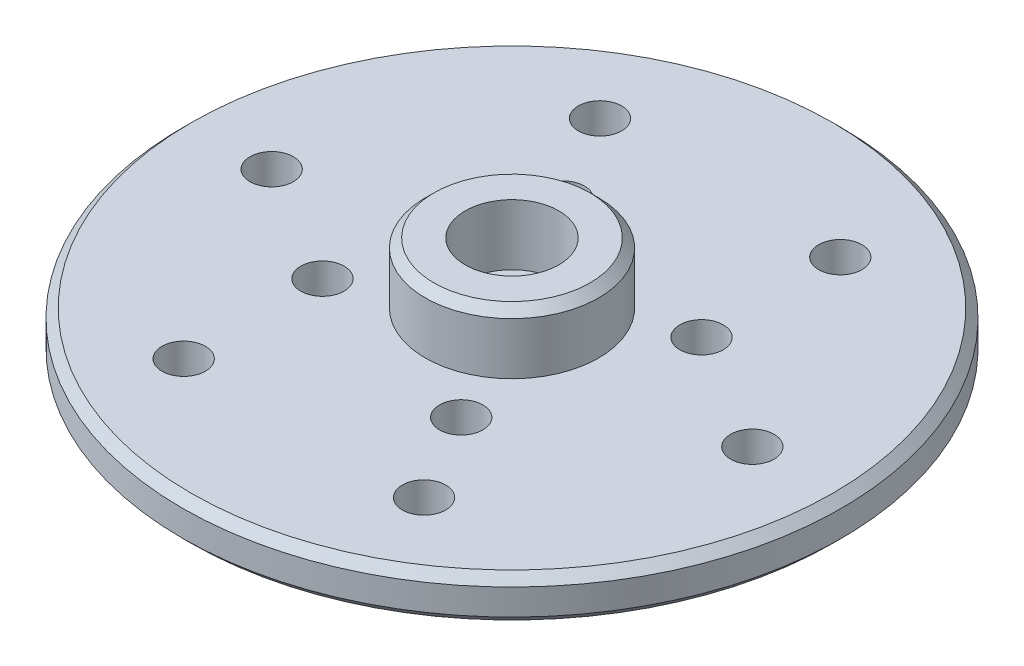
ISO-10303-21;
HEADER;
FILE_DESCRIPTION(('STEP AP214'),'2;1');
FILE_NAME('part.step','',(''),(''),'','','');
FILE_SCHEMA(('AUTOMOTIVE_DESIGN { 1 0 10303 214 1 1 1 1 }'));
ENDSEC;
DATA;
#1=APPLICATION_CONTEXT('core data for automotive mechanical design processes');
#2=APPLICATION_PROTOCOL_DEFINITION('international standard','automotive_design',2000,#1);
#3=PRODUCT_CONTEXT('',#1,'mechanical');
#4=PRODUCT('Part','Part','',(#3));
#5=PRODUCT_RELATED_PRODUCT_CATEGORY('part','',(#4));
#6=PRODUCT_DEFINITION_FORMATION('','',#4);
#7=PRODUCT_DEFINITION_CONTEXT('part definition',#1,'design');
#8=PRODUCT_DEFINITION('design','',#6,#7);
#9=PRODUCT_DEFINITION_SHAPE('','',#8);
#10=(LENGTH_UNIT() NAMED_UNIT(*) SI_UNIT(.MILLI.,.METRE.));
#11=(NAMED_UNIT(*) PLANE_ANGLE_UNIT() SI_UNIT($,.RADIAN.));
#12=(NAMED_UNIT(*) SI_UNIT($,.STERADIAN.) SOLID_ANGLE_UNIT());
#13=UNCERTAINTY_MEASURE_WITH_UNIT(LENGTH_MEASURE(1.E-05),#10,'distance_accuracy_value','');
#14=(GEOMETRIC_REPRESENTATION_CONTEXT(3) GLOBAL_UNCERTAINTY_ASSIGNED_CONTEXT((#13)) GLOBAL_UNIT_ASSIGNED_CONTEXT((#10,
#11,#12)) REPRESENTATION_CONTEXT('',''));
#15=CARTESIAN_POINT('',(0.,0.,0.));
#16=DIRECTION('',(0.,0.,1.));
#17=DIRECTION('',(1.,0.,0.));
#18=AXIS2_PLACEMENT_3D('',#15,#16,#17);
#19=CARTESIAN_POINT('',(0.,5.50000000004047,0.));
#20=DIRECTION('',(0.,-1.,0.));
#21=DIRECTION('',(0.,0.,-1.));
#22=AXIS2_PLACEMENT_3D('',#19,#20,#21);
#23=CONICAL_SURFACE('',#22,4.99999999999545,0.785398163397448);
#24=CARTESIAN_POINT('',(0.,5.49999999999999,0.));
#25=DIRECTION('',(0.,-1.,0.));
#26=DIRECTION('',(0.,0.,-1.));
#27=AXIS2_PLACEMENT_3D('',#24,#25,#26);
#28=CIRCLE('',#27,5.);
#29=CARTESIAN_POINT('',(0.,5.49999999999999,-5.));
#30=VERTEX_POINT('',#29);
#31=EDGE_CURVE('E30',#30,#30,#28,.T.);
#32=ORIENTED_EDGE('',*,*,#31,.F.);
#33=EDGE_LOOP('',(#32));
#34=FACE_BOUND('',#33,.T.);
#35=CARTESIAN_POINT('',(0.,6.00000000002865,0.));
#36=DIRECTION('',(0.,-1.,0.));
#37=DIRECTION('',(0.,0.,-1.));
#38=AXIS2_PLACEMENT_3D('',#35,#36,#37);
#39=CIRCLE('',#38,4.50000000000728);
#40=CARTESIAN_POINT('',(0.,6.00000000002865,-4.50000000000728));
#41=VERTEX_POINT('',#40);
#42=EDGE_CURVE('E18',#41,#41,#39,.F.);
#43=ORIENTED_EDGE('',*,*,#42,.F.);
#44=EDGE_LOOP('',(#43));
#45=FACE_BOUND('',#44,.T.);
#46=ADVANCED_FACE('F15',(#34,#45),#23,.T.);
#47=CARTESIAN_POINT('',(0.,6.,0.));
#48=DIRECTION('',(0.,1.,0.));
#49=DIRECTION('',(0.,0.,1.));
#50=AXIS2_PLACEMENT_3D('',#47,#48,#49);
#51=PLANE('',#50);
#52=CARTESIAN_POINT('',(0.,6.,0.));
#53=DIRECTION('',(0.,-1.,0.));
#54=DIRECTION('',(0.,0.,-1.));
#55=AXIS2_PLACEMENT_3D('',#52,#53,#54);
#56=CIRCLE('',#55,2.7);
#57=CARTESIAN_POINT('',(0.,6.,-2.7));
#58=VERTEX_POINT('',#57);
#59=EDGE_CURVE('E105',#58,#58,#56,.T.);
#60=ORIENTED_EDGE('',*,*,#59,.T.);
#61=EDGE_LOOP('',(#60));
#62=FACE_BOUND('',#61,.T.);
#63=ORIENTED_EDGE('',*,*,#42,.T.);
#64=EDGE_LOOP('',(#63));
#65=FACE_BOUND('',#64,.T.);
#66=ADVANCED_FACE('F116',(#62,#65),#51,.T.);
#67=CARTESIAN_POINT('',(0.,2.00000000000002,0.));
#68=DIRECTION('',(0.,-1.,0.));
#69=DIRECTION('',(0.,0.,-1.));
#70=AXIS2_PLACEMENT_3D('',#67,#68,#69);
#71=CONICAL_SURFACE('',#70,19.0000000009398,0.785398163397445);
#72=CARTESIAN_POINT('',(0.,2.00000000000002,0.));
#73=DIRECTION('',(0.,-1.,0.));
#74=DIRECTION('',(0.,0.,-1.));
#75=AXIS2_PLACEMENT_3D('',#72,#73,#74);
#76=CIRCLE('',#75,19.0000000009398);
#77=CARTESIAN_POINT('',(0.,2.00000000000002,-19.0000000009398));
#78=VERTEX_POINT('',#77);
#79=EDGE_CURVE('E104',#78,#78,#76,.T.);
#80=ORIENTED_EDGE('',*,*,#79,.F.);
#81=EDGE_LOOP('',(#80));
#82=FACE_BOUND('',#81,.T.);
#83=CARTESIAN_POINT('',(0.,2.5,0.));
#84=DIRECTION('',(0.,-1.,0.));
#85=DIRECTION('',(0.,0.,-1.));
#86=AXIS2_PLACEMENT_3D('',#83,#84,#85);
#87=CIRCLE('',#86,18.5000000009398);
#88=CARTESIAN_POINT('',(0.,2.5,-18.5000000009398));
#89=VERTEX_POINT('',#88);
#90=EDGE_CURVE('E102',#89,#89,#87,.F.);
#91=ORIENTED_EDGE('',*,*,#90,.F.);
#92=EDGE_LOOP('',(#91));
#93=FACE_BOUND('',#92,.T.);
#94=ADVANCED_FACE('F123',(#82,#93),#71,.T.);
#95=CARTESIAN_POINT('',(0.,6.,0.));
#96=DIRECTION('',(0.,-1.,0.));
#97=DIRECTION('',(0.,0.,-1.));
#98=AXIS2_PLACEMENT_3D('',#95,#96,#97);
#99=CYLINDRICAL_SURFACE('',#98,5.);
#100=CARTESIAN_POINT('',(0.,2.5,0.));
#101=DIRECTION('',(0.,-1.,0.));
#102=DIRECTION('',(0.,0.,-1.));
#103=AXIS2_PLACEMENT_3D('',#100,#101,#102);
#104=CIRCLE('',#103,5.);
#105=CARTESIAN_POINT('',(0.,2.5,-5.));
#106=VERTEX_POINT('',#105);
#107=EDGE_CURVE('E99',#106,#106,#104,.T.);
#108=ORIENTED_EDGE('',*,*,#107,.F.);
#109=EDGE_LOOP('',(#108));
#110=FACE_BOUND('',#109,.T.);
#111=ORIENTED_EDGE('',*,*,#31,.T.);
#112=EDGE_LOOP('',(#111));
#113=FACE_BOUND('',#112,.T.);
#114=ADVANCED_FACE('F194',(#110,#113),#99,.T.);
#115=CARTESIAN_POINT('',(0.,6.,0.));
#116=DIRECTION('',(0.,-1.,0.));
#117=DIRECTION('',(0.,0.,-1.));
#118=AXIS2_PLACEMENT_3D('',#115,#116,#117);
#119=CYLINDRICAL_SURFACE('',#118,2.7);
#120=CARTESIAN_POINT('',(0.,2.5,0.));
#121=DIRECTION('',(0.,-1.,0.));
#122=DIRECTION('',(0.,0.,-1.));
#123=AXIS2_PLACEMENT_3D('',#120,#121,#122);
#124=CIRCLE('',#123,2.7);
#125=CARTESIAN_POINT('',(0.,2.5,-2.7));
#126=VERTEX_POINT('',#125);
#127=EDGE_CURVE('E96',#126,#126,#124,.F.);
#128=ORIENTED_EDGE('',*,*,#127,.F.);
#129=EDGE_LOOP('',(#128));
#130=FACE_BOUND('',#129,.T.);
#131=ORIENTED_EDGE('',*,*,#59,.F.);
#132=EDGE_LOOP('',(#131));
#133=FACE_BOUND('',#132,.T.);
#134=ADVANCED_FACE('F190',(#130,#133),#119,.F.);
#135=CARTESIAN_POINT('',(0.,2.5,0.));
#136=DIRECTION('',(0.,-1.,0.));
#137=DIRECTION('',(0.,0.,-1.));
#138=AXIS2_PLACEMENT_3D('',#135,#136,#137);
#139=CYLINDRICAL_SURFACE('',#138,19.0000000009398);
#140=ORIENTED_EDGE('',*,*,#79,.T.);
#141=EDGE_LOOP('',(#140));
#142=FACE_BOUND('',#141,.T.);
#143=CARTESIAN_POINT('',(0.,0.499999999999997,0.));
#144=DIRECTION('',(0.,1.,0.));
#145=DIRECTION('',(0.,0.,1.));
#146=AXIS2_PLACEMENT_3D('',#143,#144,#145);
#147=CIRCLE('',#146,19.0000000009398);
#148=CARTESIAN_POINT('',(0.,0.499999999999997,19.0000000009398));
#149=VERTEX_POINT('',#148);
#150=EDGE_CURVE('E95',#149,#149,#147,.F.);
#151=ORIENTED_EDGE('',*,*,#150,.F.);
#152=EDGE_LOOP('',(#151));
#153=FACE_BOUND('',#152,.T.);
#154=ADVANCED_FACE('F186',(#142,#153),#139,.T.);
#155=CARTESIAN_POINT('',(0.,2.5,0.));
#156=DIRECTION('',(0.,1.,0.));
#157=DIRECTION('',(0.,0.,1.));
#158=AXIS2_PLACEMENT_3D('',#155,#156,#157);
#159=PLANE('',#158);
#160=CARTESIAN_POINT('',(4.0000000009961,2.5,6.92820323018273));
#161=DIRECTION('',(0.,-1.,0.));
#162=DIRECTION('',(0.,0.,-1.));
#163=AXIS2_PLACEMENT_3D('',#160,#161,#162);
#164=CIRCLE('',#163,1.24999999999886);
#165=CARTESIAN_POINT('',(4.0000000009961,2.5,5.67820323018386));
#166=VERTEX_POINT('',#165);
#167=EDGE_CURVE('E68',#166,#166,#164,.T.);
#168=ORIENTED_EDGE('',*,*,#167,.T.);
#169=EDGE_LOOP('',(#168));
#170=FACE_BOUND('',#169,.T.);
#171=CARTESIAN_POINT('',(-6.92820323019561,2.5,4.00000000097478));
#172=DIRECTION('',(0.,-1.,0.));
#173=DIRECTION('',(0.,0.,-1.));
#174=AXIS2_PLACEMENT_3D('',#171,#172,#173);
#175=CIRCLE('',#174,1.24999999999886);
#176=CARTESIAN_POINT('',(-6.92820323019561,2.5,2.75000000097592));
#177=VERTEX_POINT('',#176);
#178=EDGE_CURVE('E74',#177,#177,#175,.T.);
#179=ORIENTED_EDGE('',*,*,#178,.T.);
#180=EDGE_LOOP('',(#179));
#181=FACE_BOUND('',#180,.T.);
#182=CARTESIAN_POINT('',(-4.0000000010032,2.5,-6.92820323017962));
#183=DIRECTION('',(0.,-1.,0.));
#184=DIRECTION('',(0.,0.,-1.));
#185=AXIS2_PLACEMENT_3D('',#182,#183,#184);
#186=CIRCLE('',#185,1.24999999999886);
#187=CARTESIAN_POINT('',(-4.0000000010032,2.5,-8.17820323017848));
#188=VERTEX_POINT('',#187);
#189=EDGE_CURVE('E80',#188,#188,#186,.T.);
#190=ORIENTED_EDGE('',*,*,#189,.T.);
#191=EDGE_LOOP('',(#190));
#192=FACE_BOUND('',#191,.T.);
#193=CARTESIAN_POINT('',(13.8564064603592,2.5,0.));
#194=DIRECTION('',(0.,-1.,0.));
#195=DIRECTION('',(0.,0.,-1.));
#196=AXIS2_PLACEMENT_3D('',#193,#194,#195);
#197=CIRCLE('',#196,1.24999999999886);
#198=CARTESIAN_POINT('',(13.8564064603592,2.5,-1.24999999999886));
#199=VERTEX_POINT('',#198);
#200=EDGE_CURVE('E86',#199,#199,#197,.T.);
#201=ORIENTED_EDGE('',*,*,#200,.T.);
#202=EDGE_LOOP('',(#201));
#203=FACE_BOUND('',#202,.T.);
#204=CARTESIAN_POINT('',(-6.9282032318263,2.5,-11.9999999995111));
#205=DIRECTION('',(0.,-1.,0.));
#206=DIRECTION('',(0.,0.,-1.));
#207=AXIS2_PLACEMENT_3D('',#204,#205,#206);
#208=CIRCLE('',#207,1.24999999999886);
#209=CARTESIAN_POINT('',(-6.9282032318263,2.5,-13.2499999995099));
#210=VERTEX_POINT('',#209);
#211=EDGE_CURVE('E92',#210,#210,#208,.T.);
#212=ORIENTED_EDGE('',*,*,#211,.T.);
#213=EDGE_LOOP('',(#212));
#214=FACE_BOUND('',#213,.T.);
#215=CARTESIAN_POINT('',(6.92820322963072,2.5,-11.9999999995111));
#216=DIRECTION('',(0.,-1.,0.));
#217=DIRECTION('',(0.,0.,-1.));
#218=AXIS2_PLACEMENT_3D('',#215,#216,#217);
#219=CIRCLE('',#218,1.24999999999886);
#220=CARTESIAN_POINT('',(6.92820322963072,2.5,-13.2499999995099));
#221=VERTEX_POINT('',#220);
#222=EDGE_CURVE('E89',#221,#221,#219,.T.);
#223=ORIENTED_EDGE('',*,*,#222,.T.);
#224=EDGE_LOOP('',(#223));
#225=FACE_BOUND('',#224,.T.);
#226=CARTESIAN_POINT('',(6.92820323019561,2.5,-4.00000000097478));
#227=DIRECTION('',(0.,-1.,0.));
#228=DIRECTION('',(0.,0.,-1.));
#229=AXIS2_PLACEMENT_3D('',#226,#227,#228);
#230=CIRCLE('',#229,1.24999999999886);
#231=CARTESIAN_POINT('',(6.92820323019561,2.5,-5.25000000097364));
#232=VERTEX_POINT('',#231);
#233=EDGE_CURVE('E83',#232,#232,#230,.T.);
#234=ORIENTED_EDGE('',*,*,#233,.T.);
#235=EDGE_LOOP('',(#234));
#236=FACE_BOUND('',#235,.T.);
#237=CARTESIAN_POINT('',(-13.8564064609028,2.5,0.));
#238=DIRECTION('',(0.,-1.,0.));
#239=DIRECTION('',(0.,0.,-1.));
#240=AXIS2_PLACEMENT_3D('',#237,#238,#239);
#241=CIRCLE('',#240,1.24999999999886);
#242=CARTESIAN_POINT('',(-13.8564064609028,2.5,-1.24999999999886));
#243=VERTEX_POINT('',#242);
#244=EDGE_CURVE('E77',#243,#243,#241,.T.);
#245=ORIENTED_EDGE('',*,*,#244,.T.);
#246=EDGE_LOOP('',(#245));
#247=FACE_BOUND('',#246,.T.);
#248=CARTESIAN_POINT('',(-6.92820323017784,2.5,11.9999999979203));
#249=DIRECTION('',(0.,-1.,0.));
#250=DIRECTION('',(0.,0.,-1.));
#251=AXIS2_PLACEMENT_3D('',#248,#249,#250);
#252=CIRCLE('',#251,1.24999999999886);
#253=CARTESIAN_POINT('',(-6.92820323017784,2.5,10.7499999979215));
#254=VERTEX_POINT('',#253);
#255=EDGE_CURVE('E71',#254,#254,#252,.T.);
#256=ORIENTED_EDGE('',*,*,#255,.T.);
#257=EDGE_LOOP('',(#256));
#258=FACE_BOUND('',#257,.T.);
#259=CARTESIAN_POINT('',(6.9282032318192,2.5,11.9999999995146));
#260=DIRECTION('',(0.,-1.,0.));
#261=DIRECTION('',(0.,0.,-1.));
#262=AXIS2_PLACEMENT_3D('',#259,#260,#261);
#263=CIRCLE('',#262,1.24999999999886);
#264=CARTESIAN_POINT('',(6.9282032318192,2.5,10.7499999995158));
#265=VERTEX_POINT('',#264);
#266=EDGE_CURVE('E65',#265,#265,#263,.T.);
#267=ORIENTED_EDGE('',*,*,#266,.T.);
#268=EDGE_LOOP('',(#267));
#269=FACE_BOUND('',#268,.T.);
#270=ORIENTED_EDGE('',*,*,#107,.T.);
#271=EDGE_LOOP('',(#270));
#272=FACE_BOUND('',#271,.T.);
#273=ORIENTED_EDGE('',*,*,#90,.T.);
#274=EDGE_LOOP('',(#273));
#275=FACE_BOUND('',#274,.T.);
#276=ADVANCED_FACE('F182',(#170,#181,#192,#203,#214,#225,#236,#247,#258,#269,#272,#275),#159,.T.);
#277=CARTESIAN_POINT('',(0.,2.5,0.));
#278=DIRECTION('',(0.,1.,0.));
#279=DIRECTION('',(0.,0.,1.));
#280=AXIS2_PLACEMENT_3D('',#277,#278,#279);
#281=PLANE('',#280);
#282=ORIENTED_EDGE('',*,*,#127,.T.);
#283=EDGE_LOOP('',(#282));
#284=FACE_BOUND('',#283,.T.);
#285=CARTESIAN_POINT('',(0.,2.5,0.));
#286=DIRECTION('',(0.,-1.,0.));
#287=DIRECTION('',(0.,0.,-1.));
#288=AXIS2_PLACEMENT_3D('',#285,#286,#287);
#289=CIRCLE('',#288,1.6);
#290=CARTESIAN_POINT('',(0.,2.5,-1.6));
#291=VERTEX_POINT('',#290);
#292=EDGE_CURVE('E62',#291,#291,#289,.T.);
#293=ORIENTED_EDGE('',*,*,#292,.T.);
#294=EDGE_LOOP('',(#293));
#295=FACE_BOUND('',#294,.T.);
#296=ADVANCED_FACE('F178',(#284,#295),#281,.T.);
#297=CARTESIAN_POINT('',(0.,0.499999999999997,0.));
#298=DIRECTION('',(0.,1.,0.));
#299=DIRECTION('',(0.,0.,1.));
#300=AXIS2_PLACEMENT_3D('',#297,#298,#299);
#301=CONICAL_SURFACE('',#300,19.0000000009398,0.785398163397452);
#302=CARTESIAN_POINT('',(0.,0.,0.));
#303=DIRECTION('',(0.,1.,0.));
#304=DIRECTION('',(0.,0.,1.));
#305=AXIS2_PLACEMENT_3D('',#302,#303,#304);
#306=CIRCLE('',#305,18.5000000009398);
#307=CARTESIAN_POINT('',(0.,0.,18.5000000009398));
#308=VERTEX_POINT('',#307);
#309=EDGE_CURVE('E59',#308,#308,#306,.T.);
#310=ORIENTED_EDGE('',*,*,#309,.T.);
#311=EDGE_LOOP('',(#310));
#312=FACE_BOUND('',#311,.T.);
#313=ORIENTED_EDGE('',*,*,#150,.T.);
#314=EDGE_LOOP('',(#313));
#315=FACE_BOUND('',#314,.T.);
#316=ADVANCED_FACE('F174',(#312,#315),#301,.T.);
#317=CARTESIAN_POINT('',(-6.9282032318263,2.5,-11.9999999995111));
#318=DIRECTION('',(0.,-1.,0.));
#319=DIRECTION('',(0.,0.,-1.));
#320=AXIS2_PLACEMENT_3D('',#317,#318,#319);
#321=CYLINDRICAL_SURFACE('',#320,1.24999999999886);
#322=CARTESIAN_POINT('',(-6.9282032318263,0.,-11.9999999995111));
#323=DIRECTION('',(0.,-1.,0.));
#324=DIRECTION('',(0.,0.,-1.));
#325=AXIS2_PLACEMENT_3D('',#322,#323,#324);
#326=CIRCLE('',#325,1.24999999999886);
#327=CARTESIAN_POINT('',(-6.9282032318263,0.,-13.2499999995099));
#328=VERTEX_POINT('',#327);
#329=EDGE_CURVE('E56',#328,#328,#326,.T.);
#330=ORIENTED_EDGE('',*,*,#329,.T.);
#331=EDGE_LOOP('',(#330));
#332=FACE_BOUND('',#331,.T.);
#333=ORIENTED_EDGE('',*,*,#211,.F.);
#334=EDGE_LOOP('',(#333));
#335=FACE_BOUND('',#334,.T.);
#336=ADVANCED_FACE('F170',(#332,#335),#321,.F.);
#337=CARTESIAN_POINT('',(6.92820322963072,2.5,-11.9999999995111));
#338=DIRECTION('',(0.,-1.,0.));
#339=DIRECTION('',(0.,0.,-1.));
#340=AXIS2_PLACEMENT_3D('',#337,#338,#339);
#341=CYLINDRICAL_SURFACE('',#340,1.24999999999886);
#342=CARTESIAN_POINT('',(6.92820322963072,0.,-11.9999999995111));
#343=DIRECTION('',(0.,-1.,0.));
#344=DIRECTION('',(0.,0.,-1.));
#345=AXIS2_PLACEMENT_3D('',#342,#343,#344);
#346=CIRCLE('',#345,1.24999999999886);
#347=CARTESIAN_POINT('',(6.92820322963072,0.,-13.2499999995099));
#348=VERTEX_POINT('',#347);
#349=EDGE_CURVE('E53',#348,#348,#346,.T.);
#350=ORIENTED_EDGE('',*,*,#349,.T.);
#351=EDGE_LOOP('',(#350));
#352=FACE_BOUND('',#351,.T.);
#353=ORIENTED_EDGE('',*,*,#222,.F.);
#354=EDGE_LOOP('',(#353));
#355=FACE_BOUND('',#354,.T.);
#356=ADVANCED_FACE('F166',(#352,#355),#341,.F.);
#357=CARTESIAN_POINT('',(13.8564064603592,2.5,0.));
#358=DIRECTION('',(0.,-1.,0.));
#359=DIRECTION('',(0.,0.,-1.));
#360=AXIS2_PLACEMENT_3D('',#357,#358,#359);
#361=CYLINDRICAL_SURFACE('',#360,1.24999999999886);
#362=CARTESIAN_POINT('',(13.8564064603592,0.,0.));
#363=DIRECTION('',(0.,-1.,0.));
#364=DIRECTION('',(0.,0.,-1.));
#365=AXIS2_PLACEMENT_3D('',#362,#363,#364);
#366=CIRCLE('',#365,1.24999999999886);
#367=CARTESIAN_POINT('',(13.8564064603592,0.,-1.24999999999886));
#368=VERTEX_POINT('',#367);
#369=EDGE_CURVE('E50',#368,#368,#366,.T.);
#370=ORIENTED_EDGE('',*,*,#369,.T.);
#371=EDGE_LOOP('',(#370));
#372=FACE_BOUND('',#371,.T.);
#373=ORIENTED_EDGE('',*,*,#200,.F.);
#374=EDGE_LOOP('',(#373));
#375=FACE_BOUND('',#374,.T.);
#376=ADVANCED_FACE('F162',(#372,#375),#361,.F.);
#377=CARTESIAN_POINT('',(6.92820323019561,2.5,-4.00000000097478));
#378=DIRECTION('',(0.,-1.,0.));
#379=DIRECTION('',(0.,0.,-1.));
#380=AXIS2_PLACEMENT_3D('',#377,#378,#379);
#381=CYLINDRICAL_SURFACE('',#380,1.24999999999886);
#382=CARTESIAN_POINT('',(6.92820323019561,0.,-4.00000000097478));
#383=DIRECTION('',(0.,-1.,0.));
#384=DIRECTION('',(0.,0.,-1.));
#385=AXIS2_PLACEMENT_3D('',#382,#383,#384);
#386=CIRCLE('',#385,1.24999999999886);
#387=CARTESIAN_POINT('',(6.92820323019561,0.,-5.25000000097364));
#388=VERTEX_POINT('',#387);
#389=EDGE_CURVE('E47',#388,#388,#386,.T.);
#390=ORIENTED_EDGE('',*,*,#389,.T.);
#391=EDGE_LOOP('',(#390));
#392=FACE_BOUND('',#391,.T.);
#393=ORIENTED_EDGE('',*,*,#233,.F.);
#394=EDGE_LOOP('',(#393));
#395=FACE_BOUND('',#394,.T.);
#396=ADVANCED_FACE('F158',(#392,#395),#381,.F.);
#397=CARTESIAN_POINT('',(-4.0000000010032,2.5,-6.92820323017962));
#398=DIRECTION('',(0.,-1.,0.));
#399=DIRECTION('',(0.,0.,-1.));
#400=AXIS2_PLACEMENT_3D('',#397,#398,#399);
#401=CYLINDRICAL_SURFACE('',#400,1.24999999999886);
#402=CARTESIAN_POINT('',(-4.0000000010032,0.,-6.92820323017962));
#403=DIRECTION('',(0.,-1.,0.));
#404=DIRECTION('',(0.,0.,-1.));
#405=AXIS2_PLACEMENT_3D('',#402,#403,#404);
#406=CIRCLE('',#405,1.24999999999886);
#407=CARTESIAN_POINT('',(-4.0000000010032,0.,-8.17820323017848));
#408=VERTEX_POINT('',#407);
#409=EDGE_CURVE('E44',#408,#408,#406,.T.);
#410=ORIENTED_EDGE('',*,*,#409,.T.);
#411=EDGE_LOOP('',(#410));
#412=FACE_BOUND('',#411,.T.);
#413=ORIENTED_EDGE('',*,*,#189,.F.);
#414=EDGE_LOOP('',(#413));
#415=FACE_BOUND('',#414,.T.);
#416=ADVANCED_FACE('F154',(#412,#415),#401,.F.);
#417=CARTESIAN_POINT('',(-13.8564064609028,2.5,0.));
#418=DIRECTION('',(0.,-1.,0.));
#419=DIRECTION('',(0.,0.,-1.));
#420=AXIS2_PLACEMENT_3D('',#417,#418,#419);
#421=CYLINDRICAL_SURFACE('',#420,1.24999999999886);
#422=CARTESIAN_POINT('',(-13.8564064609028,0.,0.));
#423=DIRECTION('',(0.,-1.,0.));
#424=DIRECTION('',(0.,0.,-1.));
#425=AXIS2_PLACEMENT_3D('',#422,#423,#424);
#426=CIRCLE('',#425,1.24999999999886);
#427=CARTESIAN_POINT('',(-13.8564064609028,0.,-1.24999999999886));
#428=VERTEX_POINT('',#427);
#429=EDGE_CURVE('E41',#428,#428,#426,.T.);
#430=ORIENTED_EDGE('',*,*,#429,.T.);
#431=EDGE_LOOP('',(#430));
#432=FACE_BOUND('',#431,.T.);
#433=ORIENTED_EDGE('',*,*,#244,.F.);
#434=EDGE_LOOP('',(#433));
#435=FACE_BOUND('',#434,.T.);
#436=ADVANCED_FACE('F150',(#432,#435),#421,.F.);
#437=CARTESIAN_POINT('',(-6.92820323019561,2.5,4.00000000097478));
#438=DIRECTION('',(0.,-1.,0.));
#439=DIRECTION('',(0.,0.,-1.));
#440=AXIS2_PLACEMENT_3D('',#437,#438,#439);
#441=CYLINDRICAL_SURFACE('',#440,1.24999999999886);
#442=CARTESIAN_POINT('',(-6.92820323019561,0.,4.00000000097478));
#443=DIRECTION('',(0.,-1.,0.));
#444=DIRECTION('',(0.,0.,-1.));
#445=AXIS2_PLACEMENT_3D('',#442,#443,#444);
#446=CIRCLE('',#445,1.24999999999886);
#447=CARTESIAN_POINT('',(-6.92820323019561,0.,2.75000000097592));
#448=VERTEX_POINT('',#447);
#449=EDGE_CURVE('E38',#448,#448,#446,.T.);
#450=ORIENTED_EDGE('',*,*,#449,.T.);
#451=EDGE_LOOP('',(#450));
#452=FACE_BOUND('',#451,.T.);
#453=ORIENTED_EDGE('',*,*,#178,.F.);
#454=EDGE_LOOP('',(#453));
#455=FACE_BOUND('',#454,.T.);
#456=ADVANCED_FACE('F146',(#452,#455),#441,.F.);
#457=CARTESIAN_POINT('',(-6.92820323017784,2.5,11.9999999979203));
#458=DIRECTION('',(0.,-1.,0.));
#459=DIRECTION('',(0.,0.,-1.));
#460=AXIS2_PLACEMENT_3D('',#457,#458,#459);
#461=CYLINDRICAL_SURFACE('',#460,1.24999999999886);
#462=CARTESIAN_POINT('',(-6.92820323017784,0.,11.9999999979203));
#463=DIRECTION('',(0.,-1.,0.));
#464=DIRECTION('',(0.,0.,-1.));
#465=AXIS2_PLACEMENT_3D('',#462,#463,#464);
#466=CIRCLE('',#465,1.24999999999886);
#467=CARTESIAN_POINT('',(-6.92820323017784,0.,10.7499999979215));
#468=VERTEX_POINT('',#467);
#469=EDGE_CURVE('E35',#468,#468,#466,.T.);
#470=ORIENTED_EDGE('',*,*,#469,.T.);
#471=EDGE_LOOP('',(#470));
#472=FACE_BOUND('',#471,.T.);
#473=ORIENTED_EDGE('',*,*,#255,.F.);
#474=EDGE_LOOP('',(#473));
#475=FACE_BOUND('',#474,.T.);
#476=ADVANCED_FACE('F142',(#472,#475),#461,.F.);
#477=CARTESIAN_POINT('',(4.0000000009961,2.5,6.92820323018273));
#478=DIRECTION('',(0.,-1.,0.));
#479=DIRECTION('',(0.,0.,-1.));
#480=AXIS2_PLACEMENT_3D('',#477,#478,#479);
#481=CYLINDRICAL_SURFACE('',#480,1.24999999999886);
#482=CARTESIAN_POINT('',(4.0000000009961,0.,6.92820323018273));
#483=DIRECTION('',(0.,-1.,0.));
#484=DIRECTION('',(0.,0.,-1.));
#485=AXIS2_PLACEMENT_3D('',#482,#483,#484);
#486=CIRCLE('',#485,1.24999999999886);
#487=CARTESIAN_POINT('',(4.0000000009961,0.,5.67820323018386));
#488=VERTEX_POINT('',#487);
#489=EDGE_CURVE('E27',#488,#488,#486,.T.);
#490=ORIENTED_EDGE('',*,*,#489,.T.);
#491=EDGE_LOOP('',(#490));
#492=FACE_BOUND('',#491,.T.);
#493=ORIENTED_EDGE('',*,*,#167,.F.);
#494=EDGE_LOOP('',(#493));
#495=FACE_BOUND('',#494,.T.);
#496=ADVANCED_FACE('F138',(#492,#495),#481,.F.);
#497=CARTESIAN_POINT('',(6.9282032318192,2.5,11.9999999995146));
#498=DIRECTION('',(0.,-1.,0.));
#499=DIRECTION('',(0.,0.,-1.));
#500=AXIS2_PLACEMENT_3D('',#497,#498,#499);
#501=CYLINDRICAL_SURFACE('',#500,1.24999999999886);
#502=CARTESIAN_POINT('',(6.9282032318192,0.,11.9999999995146));
#503=DIRECTION('',(0.,-1.,0.));
#504=DIRECTION('',(0.,0.,-1.));
#505=AXIS2_PLACEMENT_3D('',#502,#503,#504);
#506=CIRCLE('',#505,1.24999999999886);
#507=CARTESIAN_POINT('',(6.9282032318192,0.,10.7499999995158));
#508=VERTEX_POINT('',#507);
#509=EDGE_CURVE('E22',#508,#508,#506,.T.);
#510=ORIENTED_EDGE('',*,*,#509,.T.);
#511=EDGE_LOOP('',(#510));
#512=FACE_BOUND('',#511,.T.);
#513=ORIENTED_EDGE('',*,*,#266,.F.);
#514=EDGE_LOOP('',(#513));
#515=FACE_BOUND('',#514,.T.);
#516=ADVANCED_FACE('F132',(#512,#515),#501,.F.);
#517=CARTESIAN_POINT('',(0.,2.5,0.));
#518=DIRECTION('',(0.,-1.,0.));
#519=DIRECTION('',(0.,0.,-1.));
#520=AXIS2_PLACEMENT_3D('',#517,#518,#519);
#521=CYLINDRICAL_SURFACE('',#520,1.6);
#522=CARTESIAN_POINT('',(0.,0.,0.));
#523=DIRECTION('',(0.,-1.,0.));
#524=DIRECTION('',(0.,0.,-1.));
#525=AXIS2_PLACEMENT_3D('',#522,#523,#524);
#526=CIRCLE('',#525,1.6);
#527=CARTESIAN_POINT('',(0.,0.,-1.6));
#528=VERTEX_POINT('',#527);
#529=EDGE_CURVE('E9',#528,#528,#526,.T.);
#530=ORIENTED_EDGE('',*,*,#529,.T.);
#531=EDGE_LOOP('',(#530));
#532=FACE_BOUND('',#531,.T.);
#533=ORIENTED_EDGE('',*,*,#292,.F.);
#534=EDGE_LOOP('',(#533));
#535=FACE_BOUND('',#534,.T.);
#536=ADVANCED_FACE('F126',(#532,#535),#521,.F.);
#537=CARTESIAN_POINT('',(0.,0.,0.));
#538=DIRECTION('',(0.,1.,0.));
#539=DIRECTION('',(0.,0.,1.));
#540=AXIS2_PLACEMENT_3D('',#537,#538,#539);
#541=PLANE('',#540);
#542=ORIENTED_EDGE('',*,*,#529,.F.);
#543=EDGE_LOOP('',(#542));
#544=FACE_BOUND('',#543,.T.);
#545=ORIENTED_EDGE('',*,*,#509,.F.);
#546=EDGE_LOOP('',(#545));
#547=FACE_BOUND('',#546,.T.);
#548=ORIENTED_EDGE('',*,*,#489,.F.);
#549=EDGE_LOOP('',(#548));
#550=FACE_BOUND('',#549,.T.);
#551=ORIENTED_EDGE('',*,*,#469,.F.);
#552=EDGE_LOOP('',(#551));
#553=FACE_BOUND('',#552,.T.);
#554=ORIENTED_EDGE('',*,*,#449,.F.);
#555=EDGE_LOOP('',(#554));
#556=FACE_BOUND('',#555,.T.);
#557=ORIENTED_EDGE('',*,*,#429,.F.);
#558=EDGE_LOOP('',(#557));
#559=FACE_BOUND('',#558,.T.);
#560=ORIENTED_EDGE('',*,*,#409,.F.);
#561=EDGE_LOOP('',(#560));
#562=FACE_BOUND('',#561,.T.);
#563=ORIENTED_EDGE('',*,*,#389,.F.);
#564=EDGE_LOOP('',(#563));
#565=FACE_BOUND('',#564,.T.);
#566=ORIENTED_EDGE('',*,*,#369,.F.);
#567=EDGE_LOOP('',(#566));
#568=FACE_BOUND('',#567,.T.);
#569=ORIENTED_EDGE('',*,*,#349,.F.);
#570=EDGE_LOOP('',(#569));
#571=FACE_BOUND('',#570,.T.);
#572=ORIENTED_EDGE('',*,*,#329,.F.);
#573=EDGE_LOOP('',(#572));
#574=FACE_BOUND('',#573,.T.);
#575=ORIENTED_EDGE('',*,*,#309,.F.);
#576=EDGE_LOOP('',(#575));
#577=FACE_BOUND('',#576,.T.);
#578=ADVANCED_FACE('F124',(#544,#547,#550,#553,#556,#559,#562,#565,#568,#571,#574,#577),#541,.F.);
#579=CLOSED_SHELL('',(#46,#66,#94,#114,#134,#154,#276,#296,#316,#336,#356,#376,#396,#416,#436,
#456,#476,#496,#516,#536,#578));
#580=MANIFOLD_SOLID_BREP('B1',#579);
#581=ADVANCED_BREP_SHAPE_REPRESENTATION('',(#18,#580),#14);
#582=SHAPE_DEFINITION_REPRESENTATION(#9,#581);
ENDSEC;
END-ISO-10303-21;
